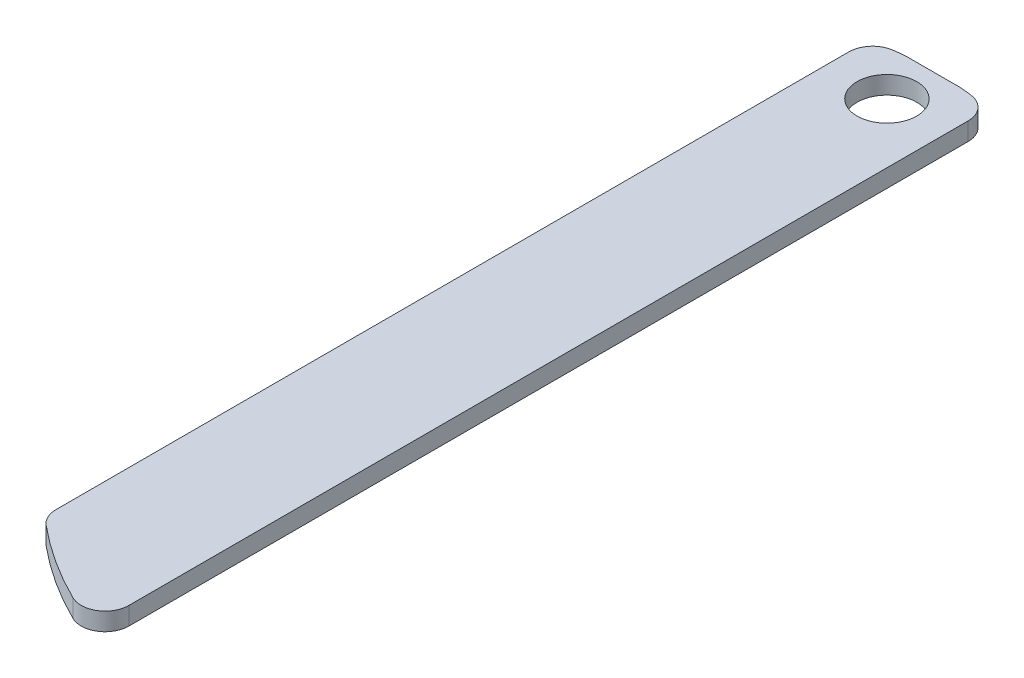
ISO-10303-21;
HEADER;
FILE_DESCRIPTION(('STEP AP214'),'2;1');
FILE_NAME('part.step','',(''),(''),'','','');
FILE_SCHEMA(('AUTOMOTIVE_DESIGN { 1 0 10303 214 1 1 1 1 }'));
ENDSEC;
DATA;
#1=APPLICATION_CONTEXT('core data for automotive mechanical design processes');
#2=APPLICATION_PROTOCOL_DEFINITION('international standard','automotive_design',2000,#1);
#3=PRODUCT_CONTEXT('',#1,'mechanical');
#4=PRODUCT('Part','Part','',(#3));
#5=PRODUCT_RELATED_PRODUCT_CATEGORY('part','',(#4));
#6=PRODUCT_DEFINITION_FORMATION('','',#4);
#7=PRODUCT_DEFINITION_CONTEXT('part definition',#1,'design');
#8=PRODUCT_DEFINITION('design','',#6,#7);
#9=PRODUCT_DEFINITION_SHAPE('','',#8);
#10=(LENGTH_UNIT() NAMED_UNIT(*) SI_UNIT(.MILLI.,.METRE.));
#11=(NAMED_UNIT(*) PLANE_ANGLE_UNIT() SI_UNIT($,.RADIAN.));
#12=(NAMED_UNIT(*) SI_UNIT($,.STERADIAN.) SOLID_ANGLE_UNIT());
#13=UNCERTAINTY_MEASURE_WITH_UNIT(LENGTH_MEASURE(1.E-05),#10,'distance_accuracy_value','');
#14=(GEOMETRIC_REPRESENTATION_CONTEXT(3) GLOBAL_UNCERTAINTY_ASSIGNED_CONTEXT((#13)) GLOBAL_UNIT_ASSIGNED_CONTEXT((#10,
#11,#12)) REPRESENTATION_CONTEXT('',''));
#15=CARTESIAN_POINT('',(0.,0.,0.));
#16=DIRECTION('',(0.,0.,1.));
#17=DIRECTION('',(1.,0.,0.));
#18=AXIS2_PLACEMENT_3D('',#15,#16,#17);
#19=CARTESIAN_POINT('',(-5.,-1.,-24.8932111423819));
#20=DIRECTION('',(0.,-1.,0.));
#21=DIRECTION('',(0.,0.,-1.));
#22=AXIS2_PLACEMENT_3D('',#19,#20,#21);
#23=PLANE('',#22);
#24=CARTESIAN_POINT('',(0.,-1.,-21.));
#25=DIRECTION('',(0.,-1.,0.));
#26=DIRECTION('',(0.,0.,-1.));
#27=AXIS2_PLACEMENT_3D('',#24,#25,#26);
#28=CIRCLE('',#27,2.5);
#29=CARTESIAN_POINT('',(0.,-1.,-23.5));
#30=VERTEX_POINT('',#29);
#31=EDGE_CURVE('E189',#30,#30,#28,.T.);
#32=ORIENTED_EDGE('',*,*,#31,.T.);
#33=EDGE_LOOP('',(#32));
#34=FACE_BOUND('',#33,.T.);
#35=CARTESIAN_POINT('',(-3.,-1.,-22.8035085019828));
#36=DIRECTION('',(0.,-1.,0.));
#37=DIRECTION('',(0.,0.,-1.));
#38=AXIS2_PLACEMENT_3D('',#35,#36,#37);
#39=CIRCLE('',#38,2.);
#40=CARTESIAN_POINT('',(-3.26086956521739,-1.,-24.7864222847639));
#41=VERTEX_POINT('',#40);
#42=CARTESIAN_POINT('',(-5.,-1.,-22.8035085019828));
#43=VERTEX_POINT('',#42);
#44=EDGE_CURVE('E190',#41,#43,#39,.F.);
#45=ORIENTED_EDGE('',*,*,#44,.T.);
#46=DIRECTION('',(0.,0.,1.));
#47=VECTOR('',#46,1.);
#48=CARTESIAN_POINT('',(-5.,-1.,-24.8932111423819));
#49=LINE('',#48,#47);
#50=CARTESIAN_POINT('',(-5.00000000000001,-1.,43.5857624072037));
#51=VERTEX_POINT('',#50);
#52=EDGE_CURVE('E64',#43,#51,#49,.T.);
#53=ORIENTED_EDGE('',*,*,#52,.T.);
#54=CARTESIAN_POINT('',(-3.00000000000001,-1.,43.5857624072037));
#55=DIRECTION('',(0.,-1.,0.));
#56=DIRECTION('',(0.,0.,-1.));
#57=AXIS2_PLACEMENT_3D('',#54,#55,#56);
#58=CIRCLE('',#57,2.);
#59=CARTESIAN_POINT('',(-4.27921540127676,-1.,45.123165398334));
#60=VERTEX_POINT('',#59);
#61=EDGE_CURVE('E11',#51,#60,#58,.F.);
#62=ORIENTED_EDGE('',*,*,#61,.T.);
#63=CARTESIAN_POINT('',(16.1882310191513,-1.,20.5247175402494));
#64=DIRECTION('',(0.,-1.,0.));
#65=DIRECTION('',(0.,0.,-1.));
#66=AXIS2_PLACEMENT_3D('',#63,#64,#65);
#67=CIRCLE('',#66,32.);
#68=CARTESIAN_POINT('',(2.12078459872326,-1.,49.2667938606614));
#69=VERTEX_POINT('',#68);
#70=EDGE_CURVE('E58',#69,#60,#67,.T.);
#71=ORIENTED_EDGE('',*,*,#70,.F.);
#72=CARTESIAN_POINT('',(3.00000000000001,-1.,47.4704140906356));
#73=DIRECTION('',(0.,-1.,0.));
#74=DIRECTION('',(0.,0.,-1.));
#75=AXIS2_PLACEMENT_3D('',#72,#73,#74);
#76=CIRCLE('',#75,2.);
#77=CARTESIAN_POINT('',(5.00000000000001,-1.,47.4704140906356));
#78=VERTEX_POINT('',#77);
#79=EDGE_CURVE('E46',#69,#78,#76,.F.);
#80=ORIENTED_EDGE('',*,*,#79,.T.);
#81=DIRECTION('',(0.,0.,1.));
#82=VECTOR('',#81,1.);
#83=CARTESIAN_POINT('',(5.,-1.,-24.8932111423819));
#84=LINE('',#83,#82);
#85=CARTESIAN_POINT('',(5.,-1.,-22.8035085019828));
#86=VERTEX_POINT('',#85);
#87=EDGE_CURVE('E117',#86,#78,#84,.T.);
#88=ORIENTED_EDGE('',*,*,#87,.F.);
#89=CARTESIAN_POINT('',(3.,-1.,-22.8035085019828));
#90=DIRECTION('',(0.,-1.,0.));
#91=DIRECTION('',(0.,0.,-1.));
#92=AXIS2_PLACEMENT_3D('',#89,#90,#91);
#93=CIRCLE('',#92,2.);
#94=CARTESIAN_POINT('',(3.26086956521739,-1.,-24.7864222847639));
#95=VERTEX_POINT('',#94);
#96=EDGE_CURVE('E119',#86,#95,#93,.F.);
#97=ORIENTED_EDGE('',*,*,#96,.T.);
#98=CARTESIAN_POINT('',(0.,-1.,0.));
#99=DIRECTION('',(0.,-1.,0.));
#100=DIRECTION('',(0.,0.,-1.));
#101=AXIS2_PLACEMENT_3D('',#98,#99,#100);
#102=CIRCLE('',#101,25.);
#103=CARTESIAN_POINT('',(2.30825453986164,-1.,-24.8932111423819));
#104=VERTEX_POINT('',#103);
#105=EDGE_CURVE('E132',#104,#95,#102,.T.);
#106=ORIENTED_EDGE('',*,*,#105,.F.);
#107=DIRECTION('',(-1.,0.,0.));
#108=VECTOR('',#107,1.);
#109=CARTESIAN_POINT('',(0.,-1.,-24.8932111423819));
#110=LINE('',#109,#108);
#111=CARTESIAN_POINT('',(-2.30825453986164,-1.,-24.8932111423819));
#112=VERTEX_POINT('',#111);
#113=EDGE_CURVE('E174',#104,#112,#110,.T.);
#114=ORIENTED_EDGE('',*,*,#113,.T.);
#115=CARTESIAN_POINT('',(0.,-1.,0.));
#116=DIRECTION('',(0.,-1.,0.));
#117=DIRECTION('',(0.,0.,-1.));
#118=AXIS2_PLACEMENT_3D('',#115,#116,#117);
#119=CIRCLE('',#118,25.);
#120=EDGE_CURVE('E180',#41,#112,#119,.T.);
#121=ORIENTED_EDGE('',*,*,#120,.F.);
#122=EDGE_LOOP('',(#45,#53,#62,#71,#80,#88,#97,#106,#114,#121));
#123=FACE_BOUND('',#122,.T.);
#124=ADVANCED_FACE('F42',(#34,#123),#23,.F.);
#125=CARTESIAN_POINT('',(16.1882310191513,2.5,20.5247175402494));
#126=DIRECTION('',(0.,-1.,0.));
#127=DIRECTION('',(0.,0.,-1.));
#128=AXIS2_PLACEMENT_3D('',#125,#126,#127);
#129=CYLINDRICAL_SURFACE('',#128,32.);
#130=DIRECTION('',(0.,-1.,0.));
#131=VECTOR('',#130,1.);
#132=CARTESIAN_POINT('',(2.12078459872326,2.5,49.2667938606614));
#133=LINE('',#132,#131);
#134=CARTESIAN_POINT('',(2.12078459872326,-2.5,49.2667938606614));
#135=VERTEX_POINT('',#134);
#136=EDGE_CURVE('E158',#135,#69,#133,.F.);
#137=ORIENTED_EDGE('',*,*,#136,.T.);
#138=ORIENTED_EDGE('',*,*,#70,.T.);
#139=DIRECTION('',(0.,-1.,0.));
#140=VECTOR('',#139,1.);
#141=CARTESIAN_POINT('',(-4.27921540127676,2.5,45.123165398334));
#142=LINE('',#141,#140);
#143=CARTESIAN_POINT('',(-4.27921540127676,-2.5,45.123165398334));
#144=VERTEX_POINT('',#143);
#145=EDGE_CURVE('E156',#60,#144,#142,.T.);
#146=ORIENTED_EDGE('',*,*,#145,.T.);
#147=CARTESIAN_POINT('',(16.1882310191513,-2.5,20.5247175402494));
#148=DIRECTION('',(0.,1.,0.));
#149=DIRECTION('',(0.,0.,-1.));
#150=AXIS2_PLACEMENT_3D('',#147,#148,#149);
#151=CIRCLE('',#150,32.);
#152=EDGE_CURVE('E201',#144,#135,#151,.T.);
#153=ORIENTED_EDGE('',*,*,#152,.T.);
#154=EDGE_LOOP('',(#137,#138,#146,#153));
#155=FACE_BOUND('',#154,.T.);
#156=ADVANCED_FACE('F224',(#155),#129,.T.);
#157=CARTESIAN_POINT('',(0.,2.5,0.));
#158=DIRECTION('',(0.,-1.,0.));
#159=DIRECTION('',(0.,0.,-1.));
#160=AXIS2_PLACEMENT_3D('',#157,#158,#159);
#161=CYLINDRICAL_SURFACE('',#160,25.);
#162=DIRECTION('',(0.,-1.,0.));
#163=VECTOR('',#162,1.);
#164=CARTESIAN_POINT('',(-3.26086956521739,2.5,-24.7864222847639));
#165=LINE('',#164,#163);
#166=CARTESIAN_POINT('',(-3.26086956521739,-2.5,-24.7864222847639));
#167=VERTEX_POINT('',#166);
#168=EDGE_CURVE('E166',#167,#41,#165,.F.);
#169=ORIENTED_EDGE('',*,*,#168,.T.);
#170=ORIENTED_EDGE('',*,*,#120,.T.);
#171=DIRECTION('',(0.,-1.,0.));
#172=VECTOR('',#171,1.);
#173=CARTESIAN_POINT('',(-2.30825453986155,2.5,-24.8932111423819));
#174=LINE('',#173,#172);
#175=CARTESIAN_POINT('',(-2.30825453986155,-2.5,-24.8932111423819));
#176=VERTEX_POINT('',#175);
#177=EDGE_CURVE('E169',#176,#112,#174,.F.);
#178=ORIENTED_EDGE('',*,*,#177,.F.);
#179=CARTESIAN_POINT('',(0.,-2.5,0.));
#180=DIRECTION('',(0.,1.,0.));
#181=DIRECTION('',(0.,0.,-1.));
#182=AXIS2_PLACEMENT_3D('',#179,#180,#181);
#183=CIRCLE('',#182,25.);
#184=EDGE_CURVE('E208',#176,#167,#183,.T.);
#185=ORIENTED_EDGE('',*,*,#184,.T.);
#186=EDGE_LOOP('',(#169,#170,#178,#185));
#187=FACE_BOUND('',#186,.T.);
#188=ADVANCED_FACE('F186',(#187),#161,.T.);
#189=CARTESIAN_POINT('',(3.,2.5,-22.8035085019828));
#190=DIRECTION('',(0.,-1.,0.));
#191=DIRECTION('',(0.,0.,-1.));
#192=AXIS2_PLACEMENT_3D('',#189,#190,#191);
#193=CYLINDRICAL_SURFACE('',#192,2.);
#194=ORIENTED_EDGE('',*,*,#96,.F.);
#195=DIRECTION('',(0.,-1.,0.));
#196=VECTOR('',#195,1.);
#197=CARTESIAN_POINT('',(5.,2.5,-22.8035085019828));
#198=LINE('',#197,#196);
#199=CARTESIAN_POINT('',(5.,-2.5,-22.8035085019828));
#200=VERTEX_POINT('',#199);
#201=EDGE_CURVE('E130',#200,#86,#198,.F.);
#202=ORIENTED_EDGE('',*,*,#201,.F.);
#203=CARTESIAN_POINT('',(3.,-2.5,-22.8035085019828));
#204=DIRECTION('',(0.,-1.,0.));
#205=DIRECTION('',(0.,0.,-1.));
#206=AXIS2_PLACEMENT_3D('',#203,#204,#205);
#207=CIRCLE('',#206,2.);
#208=CARTESIAN_POINT('',(3.26086956521739,-2.5,-24.7864222847639));
#209=VERTEX_POINT('',#208);
#210=EDGE_CURVE('E141',#209,#200,#207,.T.);
#211=ORIENTED_EDGE('',*,*,#210,.F.);
#212=DIRECTION('',(0.,-1.,0.));
#213=VECTOR('',#212,1.);
#214=CARTESIAN_POINT('',(3.26086956521739,2.5,-24.7864222847639));
#215=LINE('',#214,#213);
#216=EDGE_CURVE('E131',#95,#209,#215,.T.);
#217=ORIENTED_EDGE('',*,*,#216,.F.);
#218=EDGE_LOOP('',(#194,#202,#211,#217));
#219=FACE_BOUND('',#218,.T.);
#220=ADVANCED_FACE('F44',(#219),#193,.T.);
#221=CARTESIAN_POINT('',(16.1882310191513,-2.5,20.5247175402494));
#222=DIRECTION('',(0.,-1.,0.));
#223=DIRECTION('',(0.,0.,-1.));
#224=AXIS2_PLACEMENT_3D('',#221,#222,#223);
#225=PLANE('',#224);
#226=CARTESIAN_POINT('',(0.,-2.5,-21.));
#227=DIRECTION('',(0.,1.,0.));
#228=DIRECTION('',(0.,0.,1.));
#229=AXIS2_PLACEMENT_3D('',#226,#227,#228);
#230=CIRCLE('',#229,2.5);
#231=CARTESIAN_POINT('',(0.,-2.5,-18.5));
#232=VERTEX_POINT('',#231);
#233=EDGE_CURVE('E198',#232,#232,#230,.T.);
#234=ORIENTED_EDGE('',*,*,#233,.T.);
#235=EDGE_LOOP('',(#234));
#236=FACE_BOUND('',#235,.T.);
#237=ORIENTED_EDGE('',*,*,#184,.F.);
#238=DIRECTION('',(1.,0.,0.));
#239=VECTOR('',#238,1.);
#240=CARTESIAN_POINT('',(16.1882310191513,-2.5,-24.8932111423819));
#241=LINE('',#240,#239);
#242=CARTESIAN_POINT('',(2.30825453986153,-2.5,-24.8932111423819));
#243=VERTEX_POINT('',#242);
#244=EDGE_CURVE('E194',#176,#243,#241,.T.);
#245=ORIENTED_EDGE('',*,*,#244,.T.);
#246=EDGE_CURVE('E144',#209,#243,#183,.T.);
#247=ORIENTED_EDGE('',*,*,#246,.F.);
#248=ORIENTED_EDGE('',*,*,#210,.T.);
#249=DIRECTION('',(0.,0.,-1.));
#250=VECTOR('',#249,1.);
#251=CARTESIAN_POINT('',(5.,-2.5,-24.4948974278318));
#252=LINE('',#251,#250);
#253=CARTESIAN_POINT('',(5.00000000000001,-2.5,47.4704140906356));
#254=VERTEX_POINT('',#253);
#255=EDGE_CURVE('E137',#254,#200,#252,.T.);
#256=ORIENTED_EDGE('',*,*,#255,.F.);
#257=CARTESIAN_POINT('',(3.00000000000001,-2.5,47.4704140906356));
#258=DIRECTION('',(0.,-1.,0.));
#259=DIRECTION('',(0.,0.,-1.));
#260=AXIS2_PLACEMENT_3D('',#257,#258,#259);
#261=CIRCLE('',#260,2.);
#262=EDGE_CURVE('E154',#254,#135,#261,.T.);
#263=ORIENTED_EDGE('',*,*,#262,.T.);
#264=ORIENTED_EDGE('',*,*,#152,.F.);
#265=CARTESIAN_POINT('',(-3.00000000000001,-2.5,43.5857624072037));
#266=DIRECTION('',(0.,-1.,0.));
#267=DIRECTION('',(0.,0.,-1.));
#268=AXIS2_PLACEMENT_3D('',#265,#266,#267);
#269=CIRCLE('',#268,2.);
#270=CARTESIAN_POINT('',(-5.00000000000001,-2.5,43.5857624072037));
#271=VERTEX_POINT('',#270);
#272=EDGE_CURVE('E152',#144,#271,#269,.T.);
#273=ORIENTED_EDGE('',*,*,#272,.T.);
#274=DIRECTION('',(0.,0.,1.));
#275=VECTOR('',#274,1.);
#276=CARTESIAN_POINT('',(-5.00000000000001,-2.5,44.5051025721682));
#277=LINE('',#276,#275);
#278=CARTESIAN_POINT('',(-5.,-2.5,-22.8035085019828));
#279=VERTEX_POINT('',#278);
#280=EDGE_CURVE('E139',#279,#271,#277,.T.);
#281=ORIENTED_EDGE('',*,*,#280,.F.);
#282=CARTESIAN_POINT('',(-3.,-2.5,-22.8035085019828));
#283=DIRECTION('',(0.,-1.,0.));
#284=DIRECTION('',(0.,0.,-1.));
#285=AXIS2_PLACEMENT_3D('',#282,#283,#284);
#286=CIRCLE('',#285,2.);
#287=EDGE_CURVE('E149',#279,#167,#286,.T.);
#288=ORIENTED_EDGE('',*,*,#287,.T.);
#289=EDGE_LOOP('',(#237,#245,#247,#248,#256,#263,#264,#273,#281,#288));
#290=FACE_BOUND('',#289,.T.);
#291=ADVANCED_FACE('F212',(#236,#290),#225,.T.);
#292=CARTESIAN_POINT('',(3.00000000000001,2.5,47.4704140906356));
#293=DIRECTION('',(0.,-1.,0.));
#294=DIRECTION('',(0.,0.,-1.));
#295=AXIS2_PLACEMENT_3D('',#292,#293,#294);
#296=CYLINDRICAL_SURFACE('',#295,2.);
#297=ORIENTED_EDGE('',*,*,#79,.F.);
#298=ORIENTED_EDGE('',*,*,#136,.F.);
#299=ORIENTED_EDGE('',*,*,#262,.F.);
#300=DIRECTION('',(0.,-1.,0.));
#301=VECTOR('',#300,1.);
#302=CARTESIAN_POINT('',(5.00000000000001,2.5,47.4704140906356));
#303=LINE('',#302,#301);
#304=EDGE_CURVE('E138',#78,#254,#303,.T.);
#305=ORIENTED_EDGE('',*,*,#304,.F.);
#306=EDGE_LOOP('',(#297,#298,#299,#305));
#307=FACE_BOUND('',#306,.T.);
#308=ADVANCED_FACE('F227',(#307),#296,.T.);
#309=CARTESIAN_POINT('',(5.,2.5,-24.4948974278318));
#310=DIRECTION('',(-1.,0.,0.));
#311=DIRECTION('',(0.,0.,1.));
#312=AXIS2_PLACEMENT_3D('',#309,#310,#311);
#313=PLANE('',#312);
#314=ORIENTED_EDGE('',*,*,#87,.T.);
#315=ORIENTED_EDGE('',*,*,#304,.T.);
#316=ORIENTED_EDGE('',*,*,#255,.T.);
#317=ORIENTED_EDGE('',*,*,#201,.T.);
#318=EDGE_LOOP('',(#314,#315,#316,#317));
#319=FACE_BOUND('',#318,.T.);
#320=ADVANCED_FACE('F135',(#319),#313,.F.);
#321=DIRECTION('',(0.,-1.,0.));
#322=VECTOR('',#321,1.);
#323=CARTESIAN_POINT('',(2.30825453986155,2.5,-24.8932111423819));
#324=LINE('',#323,#322);
#325=EDGE_CURVE('E172',#104,#243,#324,.T.);
#326=ORIENTED_EDGE('',*,*,#325,.F.);
#327=ORIENTED_EDGE('',*,*,#105,.T.);
#328=ORIENTED_EDGE('',*,*,#216,.T.);
#329=ORIENTED_EDGE('',*,*,#246,.T.);
#330=EDGE_LOOP('',(#326,#327,#328,#329));
#331=FACE_BOUND('',#330,.T.);
#332=ADVANCED_FACE('F219',(#331),#161,.T.);
#333=CARTESIAN_POINT('',(0.,2.5,-24.8932111423819));
#334=DIRECTION('',(0.,0.,-1.));
#335=DIRECTION('',(-1.,0.,0.));
#336=AXIS2_PLACEMENT_3D('',#333,#334,#335);
#337=PLANE('',#336);
#338=ORIENTED_EDGE('',*,*,#113,.F.);
#339=ORIENTED_EDGE('',*,*,#325,.T.);
#340=ORIENTED_EDGE('',*,*,#244,.F.);
#341=ORIENTED_EDGE('',*,*,#177,.T.);
#342=EDGE_LOOP('',(#338,#339,#340,#341));
#343=FACE_BOUND('',#342,.T.);
#344=ADVANCED_FACE('F192',(#343),#337,.T.);
#345=CARTESIAN_POINT('',(-3.,2.5,-22.8035085019828));
#346=DIRECTION('',(0.,-1.,0.));
#347=DIRECTION('',(0.,0.,-1.));
#348=AXIS2_PLACEMENT_3D('',#345,#346,#347);
#349=CYLINDRICAL_SURFACE('',#348,2.);
#350=ORIENTED_EDGE('',*,*,#44,.F.);
#351=ORIENTED_EDGE('',*,*,#168,.F.);
#352=ORIENTED_EDGE('',*,*,#287,.F.);
#353=DIRECTION('',(0.,-1.,0.));
#354=VECTOR('',#353,1.);
#355=CARTESIAN_POINT('',(-5.,2.5,-22.8035085019828));
#356=LINE('',#355,#354);
#357=EDGE_CURVE('E160',#43,#279,#356,.T.);
#358=ORIENTED_EDGE('',*,*,#357,.F.);
#359=EDGE_LOOP('',(#350,#351,#352,#358));
#360=FACE_BOUND('',#359,.T.);
#361=ADVANCED_FACE('F215',(#360),#349,.T.);
#362=CARTESIAN_POINT('',(-3.00000000000001,2.5,43.5857624072037));
#363=DIRECTION('',(0.,-1.,0.));
#364=DIRECTION('',(0.,0.,-1.));
#365=AXIS2_PLACEMENT_3D('',#362,#363,#364);
#366=CYLINDRICAL_SURFACE('',#365,2.);
#367=ORIENTED_EDGE('',*,*,#61,.F.);
#368=DIRECTION('',(0.,-1.,0.));
#369=VECTOR('',#368,1.);
#370=CARTESIAN_POINT('',(-5.00000000000001,2.5,43.5857624072037));
#371=LINE('',#370,#369);
#372=EDGE_CURVE('E162',#271,#51,#371,.F.);
#373=ORIENTED_EDGE('',*,*,#372,.F.);
#374=ORIENTED_EDGE('',*,*,#272,.F.);
#375=ORIENTED_EDGE('',*,*,#145,.F.);
#376=EDGE_LOOP('',(#367,#373,#374,#375));
#377=FACE_BOUND('',#376,.T.);
#378=ADVANCED_FACE('F248',(#377),#366,.T.);
#379=CARTESIAN_POINT('',(-5.00000000000001,2.5,44.5051025721682));
#380=DIRECTION('',(1.,0.,0.));
#381=DIRECTION('',(0.,0.,-1.));
#382=AXIS2_PLACEMENT_3D('',#379,#380,#381);
#383=PLANE('',#382);
#384=ORIENTED_EDGE('',*,*,#372,.T.);
#385=ORIENTED_EDGE('',*,*,#52,.F.);
#386=ORIENTED_EDGE('',*,*,#357,.T.);
#387=ORIENTED_EDGE('',*,*,#280,.T.);
#388=EDGE_LOOP('',(#384,#385,#386,#387));
#389=FACE_BOUND('',#388,.T.);
#390=ADVANCED_FACE('F242',(#389),#383,.F.);
#391=CARTESIAN_POINT('',(0.,2.5,-21.));
#392=DIRECTION('',(0.,-1.,0.));
#393=DIRECTION('',(0.,0.,-1.));
#394=AXIS2_PLACEMENT_3D('',#391,#392,#393);
#395=CYLINDRICAL_SURFACE('',#394,2.5);
#396=ORIENTED_EDGE('',*,*,#31,.F.);
#397=EDGE_LOOP('',(#396));
#398=FACE_BOUND('',#397,.T.);
#399=ORIENTED_EDGE('',*,*,#233,.F.);
#400=EDGE_LOOP('',(#399));
#401=FACE_BOUND('',#400,.T.);
#402=ADVANCED_FACE('F240',(#398,#401),#395,.F.);
#403=CLOSED_SHELL('',(#124,#156,#188,#220,#291,#308,#320,#332,#344,#361,#378,#390,#402));
#404=MANIFOLD_SOLID_BREP('B2',#403);
#405=ADVANCED_BREP_SHAPE_REPRESENTATION('',(#18,#404),#14);
#406=SHAPE_DEFINITION_REPRESENTATION(#9,#405);
ENDSEC;
END-ISO-10303-21;
